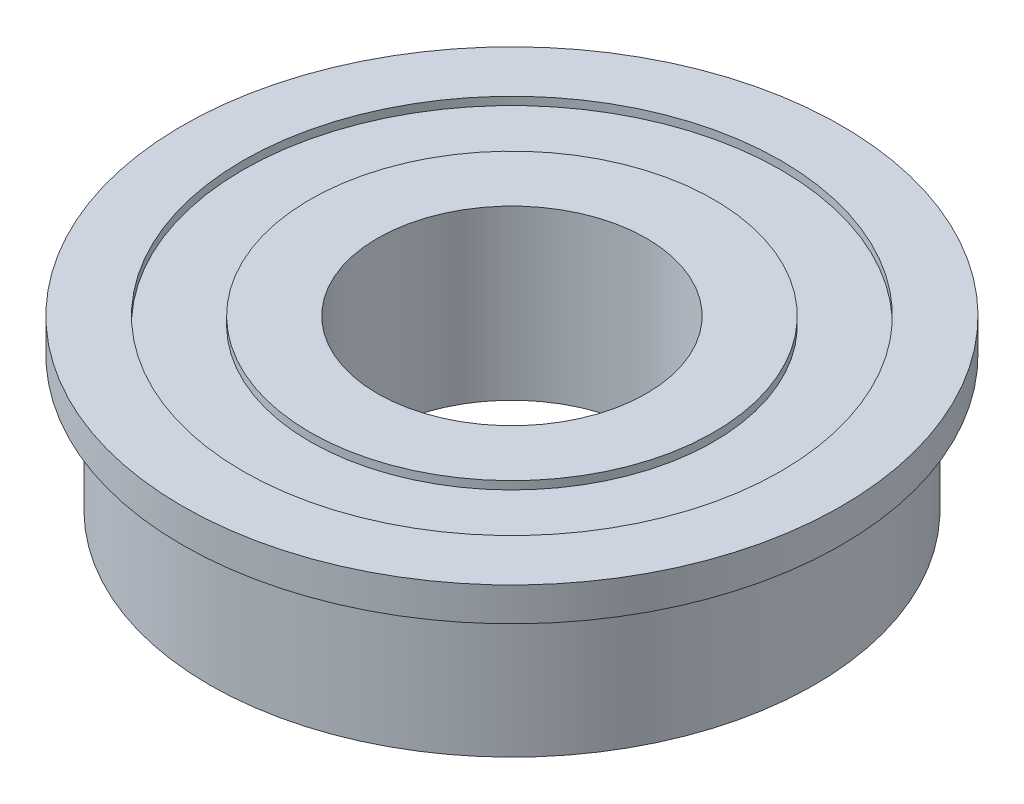
ISO-10303-21;
HEADER;
FILE_DESCRIPTION(('STEP AP214'),'2;1');
FILE_NAME('part.step','',(''),(''),'','','');
FILE_SCHEMA(('AUTOMOTIVE_DESIGN { 1 0 10303 214 1 1 1 1 }'));
ENDSEC;
DATA;
#1=APPLICATION_CONTEXT('core data for automotive mechanical design processes');
#2=APPLICATION_PROTOCOL_DEFINITION('international standard','automotive_design',2000,#1);
#3=PRODUCT_CONTEXT('',#1,'mechanical');
#4=PRODUCT('Part','Part','',(#3));
#5=PRODUCT_RELATED_PRODUCT_CATEGORY('part','',(#4));
#6=PRODUCT_DEFINITION_FORMATION('','',#4);
#7=PRODUCT_DEFINITION_CONTEXT('part definition',#1,'design');
#8=PRODUCT_DEFINITION('design','',#6,#7);
#9=PRODUCT_DEFINITION_SHAPE('','',#8);
#10=(LENGTH_UNIT() NAMED_UNIT(*) SI_UNIT(.MILLI.,.METRE.));
#11=(NAMED_UNIT(*) PLANE_ANGLE_UNIT() SI_UNIT($,.RADIAN.));
#12=(NAMED_UNIT(*) SI_UNIT($,.STERADIAN.) SOLID_ANGLE_UNIT());
#13=UNCERTAINTY_MEASURE_WITH_UNIT(LENGTH_MEASURE(1.E-05),#10,'distance_accuracy_value','');
#14=(GEOMETRIC_REPRESENTATION_CONTEXT(3) GLOBAL_UNCERTAINTY_ASSIGNED_CONTEXT((#13)) GLOBAL_UNIT_ASSIGNED_CONTEXT((#10,
#11,#12)) REPRESENTATION_CONTEXT('',''));
#15=CARTESIAN_POINT('',(0.,0.,0.));
#16=DIRECTION('',(0.,0.,1.));
#17=DIRECTION('',(1.,0.,0.));
#18=AXIS2_PLACEMENT_3D('',#15,#16,#17);
#19=CARTESIAN_POINT('',(14.2875,0.,0.));
#20=DIRECTION('',(0.,-1.,0.));
#21=DIRECTION('',(0.,0.,-1.));
#22=AXIS2_PLACEMENT_3D('',#19,#20,#21);
#23=PLANE('',#22);
#24=CARTESIAN_POINT('',(0.,0.,0.));
#25=DIRECTION('',(0.,-1.,0.));
#26=DIRECTION('',(0.,0.,-1.));
#27=AXIS2_PLACEMENT_3D('',#24,#25,#26);
#28=CIRCLE('',#27,12.7);
#29=CARTESIAN_POINT('',(0.,0.,-12.7));
#30=VERTEX_POINT('',#29);
#31=EDGE_CURVE('E55',#30,#30,#28,.F.);
#32=ORIENTED_EDGE('',*,*,#31,.F.);
#33=EDGE_LOOP('',(#32));
#34=FACE_BOUND('',#33,.T.);
#35=CARTESIAN_POINT('',(0.,0.,0.));
#36=DIRECTION('',(0.,-1.,0.));
#37=DIRECTION('',(0.,0.,-1.));
#38=AXIS2_PLACEMENT_3D('',#35,#36,#37);
#39=CIRCLE('',#38,9.525);
#40=CARTESIAN_POINT('',(0.,0.,-9.525));
#41=VERTEX_POINT('',#40);
#42=EDGE_CURVE('E10',#41,#41,#39,.F.);
#43=ORIENTED_EDGE('',*,*,#42,.T.);
#44=EDGE_LOOP('',(#43));
#45=FACE_BOUND('',#44,.T.);
#46=ADVANCED_FACE('F47',(#34,#45),#23,.T.);
#47=CARTESIAN_POINT('',(0.,0.,0.));
#48=DIRECTION('',(0.,1.,0.));
#49=DIRECTION('',(0.,0.,1.));
#50=AXIS2_PLACEMENT_3D('',#47,#48,#49);
#51=CIRCLE('',#50,14.2875);
#52=CARTESIAN_POINT('',(0.,0.,14.2875));
#53=VERTEX_POINT('',#52);
#54=EDGE_CURVE('E62',#53,#53,#51,.F.);
#55=ORIENTED_EDGE('',*,*,#54,.T.);
#56=EDGE_LOOP('',(#55));
#57=FACE_BOUND('',#56,.T.);
#58=ORIENTED_EDGE('',*,*,#31,.T.);
#59=EDGE_LOOP('',(#58));
#60=FACE_BOUND('',#59,.T.);
#61=ADVANCED_FACE('F127',(#57,#60),#23,.T.);
#62=CARTESIAN_POINT('',(0.,0.,0.));
#63=DIRECTION('',(0.,1.,0.));
#64=DIRECTION('',(0.,0.,1.));
#65=AXIS2_PLACEMENT_3D('',#62,#63,#64);
#66=CYLINDRICAL_SURFACE('',#65,12.7);
#67=CARTESIAN_POINT('',(0.,7.9375,0.));
#68=DIRECTION('',(0.,1.,0.));
#69=DIRECTION('',(0.,0.,1.));
#70=AXIS2_PLACEMENT_3D('',#67,#68,#69);
#71=CIRCLE('',#70,12.7);
#72=CARTESIAN_POINT('',(0.,7.9375,12.7));
#73=VERTEX_POINT('',#72);
#74=EDGE_CURVE('E76',#73,#73,#71,.F.);
#75=ORIENTED_EDGE('',*,*,#74,.F.);
#76=EDGE_LOOP('',(#75));
#77=FACE_BOUND('',#76,.T.);
#78=CARTESIAN_POINT('',(0.,7.5565,0.));
#79=DIRECTION('',(0.,1.,0.));
#80=DIRECTION('',(0.,0.,1.));
#81=AXIS2_PLACEMENT_3D('',#78,#79,#80);
#82=CIRCLE('',#81,12.7);
#83=CARTESIAN_POINT('',(0.,7.5565,12.7));
#84=VERTEX_POINT('',#83);
#85=EDGE_CURVE('E72',#84,#84,#82,.T.);
#86=ORIENTED_EDGE('',*,*,#85,.F.);
#87=EDGE_LOOP('',(#86));
#88=FACE_BOUND('',#87,.T.);
#89=ADVANCED_FACE('F49',(#77,#88),#66,.F.);
#90=CARTESIAN_POINT('',(9.525,7.5565,0.));
#91=DIRECTION('',(0.,1.,0.));
#92=DIRECTION('',(0.,0.,1.));
#93=AXIS2_PLACEMENT_3D('',#90,#91,#92);
#94=PLANE('',#93);
#95=CARTESIAN_POINT('',(0.,7.5565,0.));
#96=DIRECTION('',(0.,1.,0.));
#97=DIRECTION('',(0.,0.,1.));
#98=AXIS2_PLACEMENT_3D('',#95,#96,#97);
#99=CIRCLE('',#98,9.525);
#100=CARTESIAN_POINT('',(0.,7.5565,9.525));
#101=VERTEX_POINT('',#100);
#102=EDGE_CURVE('E80',#101,#101,#99,.T.);
#103=ORIENTED_EDGE('',*,*,#102,.F.);
#104=EDGE_LOOP('',(#103));
#105=FACE_BOUND('',#104,.T.);
#106=ORIENTED_EDGE('',*,*,#85,.T.);
#107=EDGE_LOOP('',(#106));
#108=FACE_BOUND('',#107,.T.);
#109=ADVANCED_FACE('F151',(#105,#108),#94,.T.);
#110=CARTESIAN_POINT('',(12.7,7.9375,0.));
#111=DIRECTION('',(0.,1.,0.));
#112=DIRECTION('',(0.,0.,1.));
#113=AXIS2_PLACEMENT_3D('',#110,#111,#112);
#114=PLANE('',#113);
#115=ORIENTED_EDGE('',*,*,#74,.T.);
#116=EDGE_LOOP('',(#115));
#117=FACE_BOUND('',#116,.T.);
#118=CARTESIAN_POINT('',(0.,7.9375,0.));
#119=DIRECTION('',(0.,1.,0.));
#120=DIRECTION('',(0.,0.,1.));
#121=AXIS2_PLACEMENT_3D('',#118,#119,#120);
#122=CIRCLE('',#121,15.5575);
#123=CARTESIAN_POINT('',(0.,7.9375,15.5575));
#124=VERTEX_POINT('',#123);
#125=EDGE_CURVE('E84',#124,#124,#122,.F.);
#126=ORIENTED_EDGE('',*,*,#125,.F.);
#127=EDGE_LOOP('',(#126));
#128=FACE_BOUND('',#127,.T.);
#129=ADVANCED_FACE('F194',(#117,#128),#114,.T.);
#130=CARTESIAN_POINT('',(0.,0.,0.));
#131=DIRECTION('',(0.,1.,0.));
#132=DIRECTION('',(0.,0.,1.));
#133=AXIS2_PLACEMENT_3D('',#130,#131,#132);
#134=CYLINDRICAL_SURFACE('',#133,9.525);
#135=ORIENTED_EDGE('',*,*,#102,.T.);
#136=EDGE_LOOP('',(#135));
#137=FACE_BOUND('',#136,.T.);
#138=CARTESIAN_POINT('',(0.,7.9375,0.));
#139=DIRECTION('',(0.,1.,0.));
#140=DIRECTION('',(0.,0.,1.));
#141=AXIS2_PLACEMENT_3D('',#138,#139,#140);
#142=CIRCLE('',#141,9.525);
#143=CARTESIAN_POINT('',(0.,7.9375,9.525));
#144=VERTEX_POINT('',#143);
#145=EDGE_CURVE('E88',#144,#144,#142,.T.);
#146=ORIENTED_EDGE('',*,*,#145,.F.);
#147=EDGE_LOOP('',(#146));
#148=FACE_BOUND('',#147,.T.);
#149=ADVANCED_FACE('F183',(#137,#148),#134,.T.);
#150=CARTESIAN_POINT('',(0.,0.,0.));
#151=DIRECTION('',(0.,1.,0.));
#152=DIRECTION('',(0.,0.,1.));
#153=AXIS2_PLACEMENT_3D('',#150,#151,#152);
#154=CYLINDRICAL_SURFACE('',#153,15.5575);
#155=CARTESIAN_POINT('',(0.,6.35,0.));
#156=DIRECTION('',(0.,1.,0.));
#157=DIRECTION('',(0.,0.,1.));
#158=AXIS2_PLACEMENT_3D('',#155,#156,#157);
#159=CIRCLE('',#158,15.5575);
#160=CARTESIAN_POINT('',(0.,6.35,15.5575));
#161=VERTEX_POINT('',#160);
#162=EDGE_CURVE('E92',#161,#161,#159,.F.);
#163=ORIENTED_EDGE('',*,*,#162,.F.);
#164=EDGE_LOOP('',(#163));
#165=FACE_BOUND('',#164,.T.);
#166=ORIENTED_EDGE('',*,*,#125,.T.);
#167=EDGE_LOOP('',(#166));
#168=FACE_BOUND('',#167,.T.);
#169=ADVANCED_FACE('F172',(#165,#168),#154,.T.);
#170=CARTESIAN_POINT('',(6.35,7.9375,0.));
#171=DIRECTION('',(0.,1.,0.));
#172=DIRECTION('',(0.,0.,1.));
#173=AXIS2_PLACEMENT_3D('',#170,#171,#172);
#174=PLANE('',#173);
#175=CARTESIAN_POINT('',(0.,7.9375,0.));
#176=DIRECTION('',(0.,1.,0.));
#177=DIRECTION('',(0.,0.,1.));
#178=AXIS2_PLACEMENT_3D('',#175,#176,#177);
#179=CIRCLE('',#178,6.35);
#180=CARTESIAN_POINT('',(0.,7.9375,6.35));
#181=VERTEX_POINT('',#180);
#182=EDGE_CURVE('E96',#181,#181,#179,.F.);
#183=ORIENTED_EDGE('',*,*,#182,.T.);
#184=EDGE_LOOP('',(#183));
#185=FACE_BOUND('',#184,.T.);
#186=ORIENTED_EDGE('',*,*,#145,.T.);
#187=EDGE_LOOP('',(#186));
#188=FACE_BOUND('',#187,.T.);
#189=ADVANCED_FACE('F122',(#185,#188),#174,.T.);
#190=CARTESIAN_POINT('',(15.5575,6.35,0.));
#191=DIRECTION('',(0.,-1.,0.));
#192=DIRECTION('',(0.,0.,-1.));
#193=AXIS2_PLACEMENT_3D('',#190,#191,#192);
#194=PLANE('',#193);
#195=ORIENTED_EDGE('',*,*,#162,.T.);
#196=EDGE_LOOP('',(#195));
#197=FACE_BOUND('',#196,.T.);
#198=CARTESIAN_POINT('',(0.,6.35,0.));
#199=DIRECTION('',(0.,1.,0.));
#200=DIRECTION('',(0.,0.,1.));
#201=AXIS2_PLACEMENT_3D('',#198,#199,#200);
#202=CIRCLE('',#201,14.2875);
#203=CARTESIAN_POINT('',(0.,6.35,14.2875));
#204=VERTEX_POINT('',#203);
#205=EDGE_CURVE('E100',#204,#204,#202,.F.);
#206=ORIENTED_EDGE('',*,*,#205,.F.);
#207=EDGE_LOOP('',(#206));
#208=FACE_BOUND('',#207,.T.);
#209=ADVANCED_FACE('F113',(#197,#208),#194,.T.);
#210=CARTESIAN_POINT('',(0.,0.,0.));
#211=DIRECTION('',(0.,1.,0.));
#212=DIRECTION('',(0.,0.,1.));
#213=AXIS2_PLACEMENT_3D('',#210,#211,#212);
#214=CYLINDRICAL_SURFACE('',#213,6.35);
#215=ORIENTED_EDGE('',*,*,#182,.F.);
#216=EDGE_LOOP('',(#215));
#217=FACE_BOUND('',#216,.T.);
#218=CARTESIAN_POINT('',(0.,0.,0.));
#219=DIRECTION('',(0.,1.,0.));
#220=DIRECTION('',(0.,0.,1.));
#221=AXIS2_PLACEMENT_3D('',#218,#219,#220);
#222=CIRCLE('',#221,6.35);
#223=CARTESIAN_POINT('',(0.,0.,6.35));
#224=VERTEX_POINT('',#223);
#225=EDGE_CURVE('E69',#224,#224,#222,.T.);
#226=ORIENTED_EDGE('',*,*,#225,.F.);
#227=EDGE_LOOP('',(#226));
#228=FACE_BOUND('',#227,.T.);
#229=ADVANCED_FACE('F110',(#217,#228),#214,.F.);
#230=CARTESIAN_POINT('',(0.,0.,0.));
#231=DIRECTION('',(0.,1.,0.));
#232=DIRECTION('',(0.,0.,1.));
#233=AXIS2_PLACEMENT_3D('',#230,#231,#232);
#234=CYLINDRICAL_SURFACE('',#233,14.2875);
#235=ORIENTED_EDGE('',*,*,#54,.F.);
#236=EDGE_LOOP('',(#235));
#237=FACE_BOUND('',#236,.T.);
#238=ORIENTED_EDGE('',*,*,#205,.T.);
#239=EDGE_LOOP('',(#238));
#240=FACE_BOUND('',#239,.T.);
#241=ADVANCED_FACE('F112',(#237,#240),#234,.T.);
#242=ORIENTED_EDGE('',*,*,#42,.F.);
#243=EDGE_LOOP('',(#242));
#244=FACE_BOUND('',#243,.T.);
#245=ORIENTED_EDGE('',*,*,#225,.T.);
#246=EDGE_LOOP('',(#245));
#247=FACE_BOUND('',#246,.T.);
#248=ADVANCED_FACE('F108',(#244,#247),#23,.T.);
#249=CLOSED_SHELL('',(#46,#61,#89,#109,#129,#149,#169,#189,#209,#229,#241,#248));
#250=MANIFOLD_SOLID_BREP('B2',#249);
#251=ADVANCED_BREP_SHAPE_REPRESENTATION('',(#18,#250),#14);
#252=SHAPE_DEFINITION_REPRESENTATION(#9,#251);
ENDSEC;
END-ISO-10303-21;
